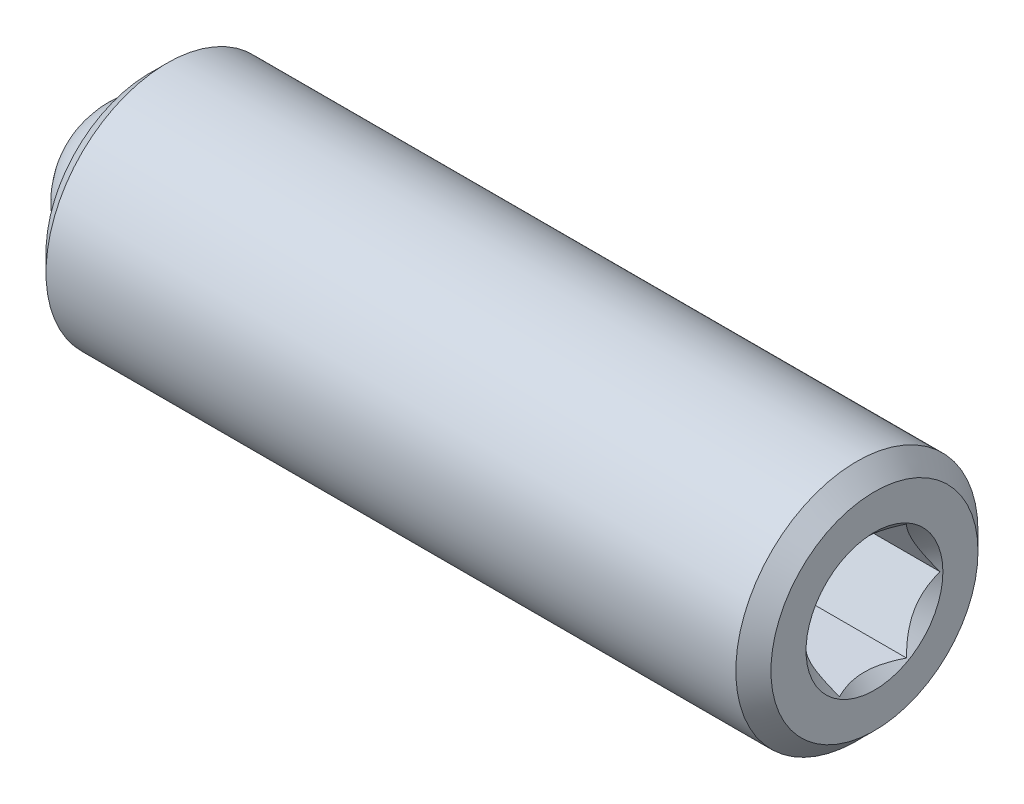
ISO-10303-21;
HEADER;
FILE_DESCRIPTION(('STEP AP214'),'2;1');
FILE_NAME('part.step','',(''),(''),'','','');
FILE_SCHEMA(('AUTOMOTIVE_DESIGN { 1 0 10303 214 1 1 1 1 }'));
ENDSEC;
DATA;
#1=APPLICATION_CONTEXT('core data for automotive mechanical design processes');
#2=APPLICATION_PROTOCOL_DEFINITION('international standard','automotive_design',2000,#1);
#3=PRODUCT_CONTEXT('',#1,'mechanical');
#4=PRODUCT('Part','Part','',(#3));
#5=PRODUCT_RELATED_PRODUCT_CATEGORY('part','',(#4));
#6=PRODUCT_DEFINITION_FORMATION('','',#4);
#7=PRODUCT_DEFINITION_CONTEXT('part definition',#1,'design');
#8=PRODUCT_DEFINITION('design','',#6,#7);
#9=PRODUCT_DEFINITION_SHAPE('','',#8);
#10=(LENGTH_UNIT() NAMED_UNIT(*) SI_UNIT(.MILLI.,.METRE.));
#11=(NAMED_UNIT(*) PLANE_ANGLE_UNIT() SI_UNIT($,.RADIAN.));
#12=(NAMED_UNIT(*) SI_UNIT($,.STERADIAN.) SOLID_ANGLE_UNIT());
#13=UNCERTAINTY_MEASURE_WITH_UNIT(LENGTH_MEASURE(1.E-05),#10,'distance_accuracy_value','');
#14=(GEOMETRIC_REPRESENTATION_CONTEXT(3) GLOBAL_UNCERTAINTY_ASSIGNED_CONTEXT((#13)) GLOBAL_UNIT_ASSIGNED_CONTEXT((#10,
#11,#12)) REPRESENTATION_CONTEXT('',''));
#15=CARTESIAN_POINT('',(0.,0.,0.));
#16=DIRECTION('',(0.,0.,1.));
#17=DIRECTION('',(1.,0.,0.));
#18=AXIS2_PLACEMENT_3D('',#15,#16,#17);
#19=CARTESIAN_POINT('',(-54.9226148346099,17.6670568230293,19.9749252728338));
#20=DIRECTION('',(1.,0.,0.));
#21=DIRECTION('',(0.,0.,-1.));
#22=AXIS2_PLACEMENT_3D('',#19,#20,#21);
#23=CYLINDRICAL_SURFACE('',#22,1.75259999999999);
#24=CARTESIAN_POINT('',(-65.1613548346099,17.6670568230293,19.9749252728338));
#25=DIRECTION('',(1.,0.,0.));
#26=DIRECTION('',(0.,0.,-1.));
#27=AXIS2_PLACEMENT_3D('',#24,#25,#26);
#28=CIRCLE('',#27,1.7526);
#29=CARTESIAN_POINT('',(-65.1613548346099,17.6670568230293,18.2223252728338));
#30=VERTEX_POINT('',#29);
#31=EDGE_CURVE('P0_E29',#30,#30,#28,.T.);
#32=ORIENTED_EDGE('',*,*,#31,.T.);
#33=EDGE_LOOP('',(#32));
#34=FACE_BOUND('',#33,.T.);
#35=CARTESIAN_POINT('',(-55.1766148346099,17.6670568230293,19.9749252728338));
#36=DIRECTION('',(1.,0.,0.));
#37=DIRECTION('',(0.,0.,-1.));
#38=AXIS2_PLACEMENT_3D('',#35,#36,#37);
#39=CIRCLE('',#38,1.75259999999998);
#40=CARTESIAN_POINT('',(-55.1766148346099,17.6670568230293,18.2223252728339));
#41=VERTEX_POINT('',#40);
#42=EDGE_CURVE('P0_E101',#41,#41,#39,.T.);
#43=ORIENTED_EDGE('',*,*,#42,.F.);
#44=EDGE_LOOP('',(#43));
#45=FACE_BOUND('',#44,.T.);
#46=ADVANCED_FACE('P0_F17',(#34,#45),#23,.T.);
#47=CARTESIAN_POINT('',(-65.4153548346099,17.6670568230293,19.9749252728338));
#48=DIRECTION('',(1.,0.,0.));
#49=DIRECTION('',(0.,0.,-1.));
#50=AXIS2_PLACEMENT_3D('',#47,#48,#49);
#51=CONICAL_SURFACE('',#50,1.49860000000003,0.785398163397484);
#52=ORIENTED_EDGE('',*,*,#31,.F.);
#53=EDGE_LOOP('',(#52));
#54=FACE_BOUND('',#53,.T.);
#55=CARTESIAN_POINT('',(-65.4153548346099,17.6670568230293,19.9749252728338));
#56=DIRECTION('',(1.,0.,0.));
#57=DIRECTION('',(0.,0.,-1.));
#58=AXIS2_PLACEMENT_3D('',#55,#56,#57);
#59=CIRCLE('',#58,1.49860000000003);
#60=CARTESIAN_POINT('',(-65.4153548346099,17.6670568230293,18.4763252728338));
#61=VERTEX_POINT('',#60);
#62=EDGE_CURVE('P0_E113',#61,#61,#59,.T.);
#63=ORIENTED_EDGE('',*,*,#62,.T.);
#64=EDGE_LOOP('',(#63));
#65=FACE_BOUND('',#64,.T.);
#66=ADVANCED_FACE('P0_F120',(#54,#65),#51,.T.);
#67=CARTESIAN_POINT('',(-65.4153548346099,8.33259115775052,19.9749252728338));
#68=DIRECTION('',(1.,0.,0.));
#69=DIRECTION('',(0.,0.,-1.));
#70=AXIS2_PLACEMENT_3D('',#67,#68,#69);
#71=PLANE('',#70);
#72=ORIENTED_EDGE('',*,*,#62,.F.);
#73=EDGE_LOOP('',(#72));
#74=FACE_BOUND('',#73,.T.);
#75=CARTESIAN_POINT('',(-65.4153548346099,17.6670568230293,19.9749252728338));
#76=DIRECTION('',(1.,0.,0.));
#77=DIRECTION('',(0.,0.,-1.));
#78=AXIS2_PLACEMENT_3D('',#75,#76,#77);
#79=CIRCLE('',#78,1.19126);
#80=CARTESIAN_POINT('',(-65.4153548346099,17.6670568230293,18.7836652728338));
#81=VERTEX_POINT('',#80);
#82=EDGE_CURVE('P0_E110',#81,#81,#79,.T.);
#83=ORIENTED_EDGE('',*,*,#82,.T.);
#84=EDGE_LOOP('',(#83));
#85=FACE_BOUND('',#84,.T.);
#86=ADVANCED_FACE('P0_F123',(#74,#85),#71,.F.);
#87=CARTESIAN_POINT('',(-54.9226148346099,17.6670568230293,19.9749252728338));
#88=DIRECTION('',(1.,0.,0.));
#89=DIRECTION('',(0.,0.,-1.));
#90=AXIS2_PLACEMENT_3D('',#87,#88,#89);
#91=CYLINDRICAL_SURFACE('',#90,1.19126);
#92=CARTESIAN_POINT('',(-64.6679187862973,17.6670568230293,19.9749252728338));
#93=DIRECTION('',(1.,0.,0.));
#94=DIRECTION('',(0.,0.,-1.));
#95=AXIS2_PLACEMENT_3D('',#92,#93,#94);
#96=CIRCLE('',#95,1.19126);
#97=CARTESIAN_POINT('',(-64.6679187862973,17.6670568230293,18.7836652728338));
#98=VERTEX_POINT('',#97);
#99=EDGE_CURVE('P0_E107',#98,#98,#96,.T.);
#100=ORIENTED_EDGE('',*,*,#99,.T.);
#101=EDGE_LOOP('',(#100));
#102=FACE_BOUND('',#101,.T.);
#103=ORIENTED_EDGE('',*,*,#82,.F.);
#104=EDGE_LOOP('',(#103));
#105=FACE_BOUND('',#104,.T.);
#106=ADVANCED_FACE('P0_F128',(#102,#105),#91,.F.);
#107=CARTESIAN_POINT('',(-63.4766587862974,17.6670568230293,19.9749252728338));
#108=DIRECTION('',(-1.,0.,0.));
#109=DIRECTION('',(0.,0.,1.));
#110=AXIS2_PLACEMENT_3D('',#107,#108,#109);
#111=CONICAL_SURFACE('',#110,0.,0.78539816339745);
#112=ORIENTED_EDGE('',*,*,#99,.F.);
#113=EDGE_LOOP('',(#112));
#114=FACE_BOUND('',#113,.T.);
#115=CARTESIAN_POINT('',(-63.4766587862974,17.6670568230293,19.9749252728338));
#116=VERTEX_POINT('',#115);
#117=VERTEX_LOOP('',#116);
#118=FACE_BOUND('',#117,.T.);
#119=ADVANCED_FACE('P0_F133',(#114,#118),#111,.F.);
#120=CARTESIAN_POINT('',(-54.9226148346099,8.33259115775052,19.9749252728338));
#121=DIRECTION('',(1.,0.,0.));
#122=DIRECTION('',(0.,0.,-1.));
#123=AXIS2_PLACEMENT_3D('',#120,#121,#122);
#124=PLANE('',#123);
#125=CARTESIAN_POINT('',(-54.9226148346099,17.6670568230293,19.9749252728338));
#126=DIRECTION('',(1.,0.,0.));
#127=DIRECTION('',(0.,0.,-1.));
#128=AXIS2_PLACEMENT_3D('',#125,#126,#127);
#129=CIRCLE('',#128,0.990600000000001);
#130=CARTESIAN_POINT('',(-54.9226148346099,17.6670568230293,18.9843252728338));
#131=VERTEX_POINT('',#130);
#132=EDGE_CURVE('P0_E284',#131,#131,#129,.T.);
#133=ORIENTED_EDGE('',*,*,#132,.F.);
#134=EDGE_LOOP('',(#133));
#135=FACE_BOUND('',#134,.T.);
#136=CARTESIAN_POINT('',(-54.9226148346099,17.6670568230293,19.9749252728338));
#137=DIRECTION('',(1.,0.,0.));
#138=DIRECTION('',(0.,0.,-1.));
#139=AXIS2_PLACEMENT_3D('',#136,#137,#138);
#140=CIRCLE('',#139,1.49860000000001);
#141=CARTESIAN_POINT('',(-54.9226148346099,17.6670568230293,18.4763252728338));
#142=VERTEX_POINT('',#141);
#143=EDGE_CURVE('P0_E104',#142,#142,#140,.T.);
#144=ORIENTED_EDGE('',*,*,#143,.T.);
#145=EDGE_LOOP('',(#144));
#146=FACE_BOUND('',#145,.T.);
#147=ADVANCED_FACE('P0_F140',(#135,#146),#124,.T.);
#148=CARTESIAN_POINT('',(-54.9226148346099,17.6670568230293,19.9749252728338));
#149=DIRECTION('',(-1.,0.,0.));
#150=DIRECTION('',(0.,0.,1.));
#151=AXIS2_PLACEMENT_3D('',#148,#149,#150);
#152=CONICAL_SURFACE('',#151,1.49860000000001,0.785398163397395);
#153=ORIENTED_EDGE('',*,*,#42,.T.);
#154=EDGE_LOOP('',(#153));
#155=FACE_BOUND('',#154,.T.);
#156=ORIENTED_EDGE('',*,*,#143,.F.);
#157=EDGE_LOOP('',(#156));
#158=FACE_BOUND('',#157,.T.);
#159=ADVANCED_FACE('P0_F176',(#155,#158),#152,.T.);
#160=CARTESIAN_POINT('',(-54.9226148346099,17.6670568230293,19.9749252728338));
#161=DIRECTION('',(1.,0.,0.));
#162=DIRECTION('',(0.,0.,-1.));
#163=AXIS2_PLACEMENT_3D('',#160,#161,#162);
#164=CONICAL_SURFACE('',#163,0.990600000000001,0.78539816339745);
#165=ORIENTED_EDGE('',*,*,#132,.T.);
#166=EDGE_LOOP('',(#165));
#167=FACE_BOUND('',#166,.T.);
#168=CARTESIAN_POINT('',(-54.9436405651255,16.8273558759166,19.4901814400065));
#169=CARTESIAN_POINT('',(-54.9602896069406,16.8562181427527,19.4735178024792));
#170=CARTESIAN_POINT('',(-54.9759608774194,16.8855629577353,19.4565755656497));
#171=CARTESIAN_POINT('',(-55.0046545524278,16.9454002240756,19.4220285038205));
#172=CARTESIAN_POINT('',(-55.0176609928538,16.9758983655022,19.4044203936581));
#173=CARTESIAN_POINT('',(-55.0399410878351,17.0373965243373,19.3689144151));
#174=CARTESIAN_POINT('',(-55.0492707427217,17.0683808795174,19.3510255892961));
#175=CARTESIAN_POINT('',(-55.0636455824224,17.1310311966433,19.3148544118386));
#176=CARTESIAN_POINT('',(-55.0687014949087,17.162695246143,19.2965731643363));
#177=CARTESIAN_POINT('',(-55.0732616796192,17.2172701926042,19.265064304306));
#178=CARTESIAN_POINT('',(-55.0739356716225,17.2401101782143,19.2518776324657));
#179=CARTESIAN_POINT('',(-55.0728008985711,17.2857458621748,19.2255298580464));
#180=CARTESIAN_POINT('',(-55.0709915852855,17.3085415496331,19.2123687617561));
#181=CARTESIAN_POINT('',(-55.0619582613821,17.3766029687753,19.1730734830929));
#182=CARTESIAN_POINT('',(-55.0511278474807,17.4215299214417,19.1471348948771));
#183=CARTESIAN_POINT('',(-55.0249992136131,17.5003581449836,19.1016233987954));
#184=CARTESIAN_POINT('',(-55.0110739425726,17.5346300462523,19.0818365073723));
#185=CARTESIAN_POINT('',(-54.9797070603181,17.6018322633575,19.0430372892364));
#186=CARTESIAN_POINT('',(-54.9622768940473,17.6347665368975,19.0240226775425));
#187=CARTESIAN_POINT('',(-54.9436405651256,17.6671068230293,19.0053510046387));
#188=B_SPLINE_CURVE_WITH_KNOTS('',3,(#168,#169,#170,#171,#172,#173,#174,#175,#176,#177,#178,
#179,#180,#181,#182,#183,#184,#185,#186,#187),.UNSPECIFIED.,.F.,.F.,(4,2,2,2,2,2,2,2,2,4),(0.,
0.11184086641355,0.22433331345316,0.335039259016712,0.445466485422691,0.524497596560953,
0.603546157935341,0.761688164949791,0.887377330429817,1.01266254554963),.UNSPECIFIED.);
#189=CARTESIAN_POINT('',(-54.9436694339282,16.8274058759166,19.490152572493));
#190=VERTEX_POINT('',#189);
#191=CARTESIAN_POINT('',(-54.9436694339282,17.6670568230293,19.0053798721522));
#192=VERTEX_POINT('',#191);
#193=EDGE_CURVE('P0_E85',#190,#192,#188,.T.);
#194=ORIENTED_EDGE('',*,*,#193,.F.);
#195=CARTESIAN_POINT('',(-54.6608222819,16.8274058759166,19.0456925823327));
#196=CARTESIAN_POINT('',(-54.6777392309002,16.8274058759166,19.0684962812722));
#197=CARTESIAN_POINT('',(-54.6944790902186,16.8274058759166,19.0914310185545));
#198=CARTESIAN_POINT('',(-54.7275326745997,16.8274058759166,19.1376143062626));
#199=CARTESIAN_POINT('',(-54.7438462866447,16.8274058759166,19.1608629374868));
#200=CARTESIAN_POINT('',(-54.7922716573543,16.8274058759166,19.231496791127));
#201=CARTESIAN_POINT('',(-54.8236073030778,16.8274058759166,19.2794232867069));
#202=CARTESIAN_POINT('',(-54.8847907056742,16.8274058759166,19.379687947564));
#203=CARTESIAN_POINT('',(-54.9144767841672,16.8274058759166,19.4321259771547));
#204=CARTESIAN_POINT('',(-54.9685436669656,16.8274058759166,19.5395709034503));
#205=CARTESIAN_POINT('',(-54.9929422838207,16.8274058759166,19.5945683922659));
#206=CARTESIAN_POINT('',(-55.0227791782577,16.8274058759166,19.6774903298755));
#207=CARTESIAN_POINT('',(-55.0314019850758,16.8274058759166,19.70426561621));
#208=CARTESIAN_POINT('',(-55.0464925522159,16.8274058759166,19.7584296604999));
#209=CARTESIAN_POINT('',(-55.0529601529813,16.8274058759166,19.7858184637157));
#210=CARTESIAN_POINT('',(-55.0633051728295,16.8274058759166,19.8406012916713));
#211=CARTESIAN_POINT('',(-55.0672251441037,16.8274058759166,19.8679871580931));
#212=CARTESIAN_POINT('',(-55.0724069079885,16.8274058759166,19.9230195994479));
#213=CARTESIAN_POINT('',(-55.0736682165128,16.8274058759166,19.9506662209386));
#214=CARTESIAN_POINT('',(-55.0734493629588,16.8274058759166,20.0050961010845));
#215=CARTESIAN_POINT('',(-55.072052407696,16.8274058759166,20.0318797353216));
#216=CARTESIAN_POINT('',(-55.0667692155749,16.8274058759166,20.0852013847964));
#217=CARTESIAN_POINT('',(-55.0628824783849,16.8274058759166,20.1117393495782));
#218=CARTESIAN_POINT('',(-55.0527594294364,16.8274058759166,20.1648222775657));
#219=CARTESIAN_POINT('',(-55.046484488545,16.8274058759166,20.1913597669272));
#220=CARTESIAN_POINT('',(-55.0319070670182,16.8274058759166,20.2438590877009));
#221=CARTESIAN_POINT('',(-55.0236047994101,16.8274058759166,20.2698209792834));
#222=CARTESIAN_POINT('',(-54.9938112359399,16.8274058759166,20.3533728316223));
#223=CARTESIAN_POINT('',(-54.9688534043347,16.8274058759166,20.4097241281571));
#224=CARTESIAN_POINT('',(-54.9134212329817,16.8274058759166,20.5197610464284));
#225=CARTESIAN_POINT('',(-54.8829266947096,16.8274058759166,20.5734359590264));
#226=CARTESIAN_POINT('',(-54.820077945697,16.8274058759166,20.6759853410194));
#227=CARTESIAN_POINT('',(-54.7878941085104,16.8274058759166,20.7249655092824));
#228=CARTESIAN_POINT('',(-54.7381680820728,16.8274058759166,20.797129117419));
#229=CARTESIAN_POINT('',(-54.7214225653475,16.8274058759166,20.8208712315236));
#230=CARTESIAN_POINT('',(-54.6874957572723,16.8274058759166,20.8680325796217));
#231=CARTESIAN_POINT('',(-54.6703145858601,16.8274058759166,20.891451899799));
#232=CARTESIAN_POINT('',(-54.6529529843744,16.8274058759166,20.9147370721701));
#233=B_SPLINE_CURVE_WITH_KNOTS('',3,(#195,#196,#197,#198,#199,#200,#201,#202,#203,#204,#205,
#206,#207,#208,#209,#210,#211,#212,#213,#214,#215,#216,#217,#218,#219,#220,#221,#222,#223,#224,
#225,#226,#227,#228,#229,#230,#231,#232),.UNSPECIFIED.,.F.,.F.,(4,2,2,2,2,2,2,2,2,2,2,2,2,2,2,2,
2,2,4),(0.,0.0851782767472509,0.170378913595555,0.342080530368617,0.522695305959887,
0.702691822093995,0.787008041035522,0.871330500779149,0.954205660968574,1.03709590966945,
1.1174341951901,1.19778863008206,1.27950219291687,1.36120717315376,1.54555233711183,
1.73058404283967,1.90632074636969,1.9934777254289,2.08061096486619),.UNSPECIFIED.);
#234=CARTESIAN_POINT('',(-54.9436694339282,16.8274058759166,20.4596979731747));
#235=VERTEX_POINT('',#234);
#236=EDGE_CURVE('P0_E271',#235,#190,#233,.F.);
#237=ORIENTED_EDGE('',*,*,#236,.F.);
#238=CARTESIAN_POINT('',(-54.9436405651256,17.6671068230293,20.944499541029));
#239=CARTESIAN_POINT('',(-54.9602896069406,17.6382445561931,20.9278359035017));
#240=CARTESIAN_POINT('',(-54.9759608774194,17.6088997412105,20.9108936666722));
#241=CARTESIAN_POINT('',(-55.0046545524278,17.5490624748702,20.876346604843));
#242=CARTESIAN_POINT('',(-55.0176609928538,17.5185643334436,20.8587384946806));
#243=CARTESIAN_POINT('',(-55.0399410878351,17.4570661746086,20.8232325161225));
#244=CARTESIAN_POINT('',(-55.0492707427217,17.4260818194285,20.8053436903186));
#245=CARTESIAN_POINT('',(-55.0636455824224,17.3634315023026,20.7691725128612));
#246=CARTESIAN_POINT('',(-55.0687014949087,17.3317674528028,20.7508912653588));
#247=CARTESIAN_POINT('',(-55.0732616796192,17.2771925063416,20.7193824053285));
#248=CARTESIAN_POINT('',(-55.0739356716225,17.2543525207316,20.7061957334882));
#249=CARTESIAN_POINT('',(-55.0728008985711,17.208716836771,20.679847959069));
#250=CARTESIAN_POINT('',(-55.0709915852855,17.1859211493128,20.6666868627786));
#251=CARTESIAN_POINT('',(-55.0619582613821,17.1178597301706,20.6273915841154));
#252=CARTESIAN_POINT('',(-55.0511278474807,17.0729327775042,20.6014529958996));
#253=CARTESIAN_POINT('',(-55.0249992136131,16.9941045539623,20.5559414998179));
#254=CARTESIAN_POINT('',(-55.0110739425726,16.9598326526936,20.5361546083948));
#255=CARTESIAN_POINT('',(-54.9797070603181,16.8926304355883,20.4973553902589));
#256=CARTESIAN_POINT('',(-54.9622768940473,16.8596961620483,20.478340778565));
#257=CARTESIAN_POINT('',(-54.9436405651255,16.8273558759166,20.4596691056612));
#258=B_SPLINE_CURVE_WITH_KNOTS('',3,(#238,#239,#240,#241,#242,#243,#244,#245,#246,#247,#248,
#249,#250,#251,#252,#253,#254,#255,#256,#257),.UNSPECIFIED.,.F.,.F.,(4,2,2,2,2,2,2,2,2,4),(0.,
0.111840866413552,0.224333313453157,0.335039259016705,0.445466485422674,0.524497596560936,
0.603546157935324,0.761688164949773,0.887377330429814,1.01266254554964),.UNSPECIFIED.);
#259=CARTESIAN_POINT('',(-54.9436694339282,17.6670568230293,20.9444706735155));
#260=VERTEX_POINT('',#259);
#261=EDGE_CURVE('P0_E267',#260,#235,#258,.T.);
#262=ORIENTED_EDGE('',*,*,#261,.F.);
#263=CARTESIAN_POINT('',(-54.9436405651255,18.506757770142,20.4596691056612));
#264=CARTESIAN_POINT('',(-54.9602896069406,18.4778955033058,20.4763327431885));
#265=CARTESIAN_POINT('',(-54.9759608774194,18.4485506883232,20.493274980018));
#266=CARTESIAN_POINT('',(-55.0046545524278,18.3887134219829,20.5278220418471));
#267=CARTESIAN_POINT('',(-55.0176609928538,18.3582152805563,20.5454301520096));
#268=CARTESIAN_POINT('',(-55.039941087835,18.2967171217213,20.5809361305677));
#269=CARTESIAN_POINT('',(-55.0492707427217,18.2657327665411,20.5988249563716));
#270=CARTESIAN_POINT('',(-55.0636455824224,18.2030824494152,20.634996133829));
#271=CARTESIAN_POINT('',(-55.0687014949087,18.1714183999155,20.6532773813313));
#272=CARTESIAN_POINT('',(-55.0732616796192,18.1168434534543,20.6847862413617));
#273=CARTESIAN_POINT('',(-55.0739356716225,18.0940034678443,20.697972913202));
#274=CARTESIAN_POINT('',(-55.0728008985711,18.0483677838837,20.7243206876212));
#275=CARTESIAN_POINT('',(-55.0709915852855,18.0255720964255,20.7374817839116));
#276=CARTESIAN_POINT('',(-55.0619582613821,17.9575106772833,20.7767770625748));
#277=CARTESIAN_POINT('',(-55.0511278474807,17.9125837246169,20.8027156507906));
#278=CARTESIAN_POINT('',(-55.0249992136131,17.833755501075,20.8482271468723));
#279=CARTESIAN_POINT('',(-55.0110739425726,17.7994835998063,20.8680140382954));
#280=CARTESIAN_POINT('',(-54.9797070603181,17.732281382701,20.9068132564313));
#281=CARTESIAN_POINT('',(-54.9622768940473,17.699347109161,20.9258278681252));
#282=CARTESIAN_POINT('',(-54.9436405651256,17.6670068230293,20.944499541029));
#283=B_SPLINE_CURVE_WITH_KNOTS('',3,(#263,#264,#265,#266,#267,#268,#269,#270,#271,#272,#273,
#274,#275,#276,#277,#278,#279,#280,#281,#282),.UNSPECIFIED.,.F.,.F.,(4,2,2,2,2,2,2,2,2,4),(0.,
0.111840866413555,0.224333313453164,0.335039259016714,0.445466485422691,0.524497596560956,
0.603546157935342,0.76168816494979,0.887377330429826,1.01266254554964),.UNSPECIFIED.);
#284=CARTESIAN_POINT('',(-54.9436694339282,18.506707770142,20.4596979731747));
#285=VERTEX_POINT('',#284);
#286=EDGE_CURVE('P0_E36',#285,#260,#283,.T.);
#287=ORIENTED_EDGE('',*,*,#286,.F.);
#288=CARTESIAN_POINT('',(-54.6608222819,18.5067077701419,19.0456925823327));
#289=CARTESIAN_POINT('',(-54.6777392309002,18.5067077701419,19.0684962812722));
#290=CARTESIAN_POINT('',(-54.6944790902186,18.5067077701419,19.0914310185545));
#291=CARTESIAN_POINT('',(-54.7275326745998,18.5067077701419,19.1376143062626));
#292=CARTESIAN_POINT('',(-54.7438462866447,18.5067077701419,19.1608629374868));
#293=CARTESIAN_POINT('',(-54.7922716573543,18.5067077701419,19.231496791127));
#294=CARTESIAN_POINT('',(-54.8236073030778,18.506707770142,19.2794232867069));
#295=CARTESIAN_POINT('',(-54.8847907056742,18.506707770142,19.379687947564));
#296=CARTESIAN_POINT('',(-54.9144767841673,18.506707770142,19.4321259771547));
#297=CARTESIAN_POINT('',(-54.9685436669656,18.506707770142,19.5395709034503));
#298=CARTESIAN_POINT('',(-54.9929422838208,18.506707770142,19.5945683922659));
#299=CARTESIAN_POINT('',(-55.0227791782578,18.506707770142,19.6774903298755));
#300=CARTESIAN_POINT('',(-55.0314019850758,18.506707770142,19.70426561621));
#301=CARTESIAN_POINT('',(-55.0464925522159,18.506707770142,19.7584296604999));
#302=CARTESIAN_POINT('',(-55.0529601529813,18.506707770142,19.7858184637157));
#303=CARTESIAN_POINT('',(-55.0633051728295,18.506707770142,19.8406012916713));
#304=CARTESIAN_POINT('',(-55.0672251441037,18.506707770142,19.8679871580931));
#305=CARTESIAN_POINT('',(-55.0724069079885,18.506707770142,19.9230195994479));
#306=CARTESIAN_POINT('',(-55.0736682165128,18.506707770142,19.9506662209386));
#307=CARTESIAN_POINT('',(-55.0734493629589,18.506707770142,20.0050961010845));
#308=CARTESIAN_POINT('',(-55.072052407696,18.506707770142,20.0318797353216));
#309=CARTESIAN_POINT('',(-55.0667692155749,18.506707770142,20.0852013847964));
#310=CARTESIAN_POINT('',(-55.0628824783849,18.506707770142,20.1117393495782));
#311=CARTESIAN_POINT('',(-55.0527594294365,18.506707770142,20.1648222775657));
#312=CARTESIAN_POINT('',(-55.046484488545,18.506707770142,20.1913597669271));
#313=CARTESIAN_POINT('',(-55.0319070670182,18.506707770142,20.2438590877009));
#314=CARTESIAN_POINT('',(-55.0236047994101,18.506707770142,20.2698209792834));
#315=CARTESIAN_POINT('',(-54.9938112359399,18.506707770142,20.3533728316222));
#316=CARTESIAN_POINT('',(-54.9688534043347,18.506707770142,20.4097241281571));
#317=CARTESIAN_POINT('',(-54.9134212329817,18.506707770142,20.5197610464284));
#318=CARTESIAN_POINT('',(-54.8829266947096,18.506707770142,20.5734359590263));
#319=CARTESIAN_POINT('',(-54.820077945697,18.506707770142,20.6759853410194));
#320=CARTESIAN_POINT('',(-54.7878941085104,18.506707770142,20.7249655092824));
#321=CARTESIAN_POINT('',(-54.7381680820728,18.506707770142,20.797129117419));
#322=CARTESIAN_POINT('',(-54.7214225653475,18.506707770142,20.8208712315236));
#323=CARTESIAN_POINT('',(-54.6874957572724,18.506707770142,20.8680325796217));
#324=CARTESIAN_POINT('',(-54.6703145858601,18.506707770142,20.891451899799));
#325=CARTESIAN_POINT('',(-54.6529529843744,18.506707770142,20.9147370721701));
#326=B_SPLINE_CURVE_WITH_KNOTS('',3,(#288,#289,#290,#291,#292,#293,#294,#295,#296,#297,#298,
#299,#300,#301,#302,#303,#304,#305,#306,#307,#308,#309,#310,#311,#312,#313,#314,#315,#316,#317,
#318,#319,#320,#321,#322,#323,#324,#325),.UNSPECIFIED.,.F.,.F.,(4,2,2,2,2,2,2,2,2,2,2,2,2,2,2,2,
2,2,4),(0.,0.0851782767472509,0.170378913595546,0.342080530368607,0.522695305959877,
0.702691822093982,0.787008041035515,0.871330500779139,0.954205660968557,1.03709590966943,
1.11743419519008,1.19778863008204,1.27950219291684,1.36120717315373,1.54555233711181,
1.73058404283964,1.90632074636966,1.99347772542888,2.08061096486616),.UNSPECIFIED.);
#327=CARTESIAN_POINT('',(-54.9436694339282,18.506707770142,19.490152572493));
#328=VERTEX_POINT('',#327);
#329=EDGE_CURVE('P0_E11',#328,#285,#326,.T.);
#330=ORIENTED_EDGE('',*,*,#329,.F.);
#331=CARTESIAN_POINT('',(-54.9436405651256,17.6670068230293,19.0053510046387));
#332=CARTESIAN_POINT('',(-54.9602896069406,17.6958690898654,19.022014642166));
#333=CARTESIAN_POINT('',(-54.9759608774194,17.725213904848,19.0389568789955));
#334=CARTESIAN_POINT('',(-55.0046545524278,17.7850511711883,19.0735039408246));
#335=CARTESIAN_POINT('',(-55.0176609928538,17.8155493126149,19.0911120509871));
#336=CARTESIAN_POINT('',(-55.0399410878351,17.87704747145,19.1266180295452));
#337=CARTESIAN_POINT('',(-55.0492707427217,17.9080318266301,19.1445068553491));
#338=CARTESIAN_POINT('',(-55.0636455824224,17.970682143756,19.1806780328065));
#339=CARTESIAN_POINT('',(-55.0687014949087,18.0023461932557,19.1989592803088));
#340=CARTESIAN_POINT('',(-55.0732616796192,18.0569211397169,19.2304681403392));
#341=CARTESIAN_POINT('',(-55.0739356716225,18.079761125327,19.2436548121795));
#342=CARTESIAN_POINT('',(-55.0728008985711,18.1253968092875,19.2700025865987));
#343=CARTESIAN_POINT('',(-55.0709915852855,18.1481924967458,19.2831636828891));
#344=CARTESIAN_POINT('',(-55.0619582613821,18.216253915888,19.3224589615523));
#345=CARTESIAN_POINT('',(-55.0511278474807,18.2611808685543,19.3483975497681));
#346=CARTESIAN_POINT('',(-55.0249992136131,18.3400090920963,19.3939090458498));
#347=CARTESIAN_POINT('',(-55.0110739425726,18.3742809933649,19.4136959372729));
#348=CARTESIAN_POINT('',(-54.9797070603181,18.4414832104702,19.4524951554087));
#349=CARTESIAN_POINT('',(-54.9622768940473,18.4744174840102,19.4715097671026));
#350=CARTESIAN_POINT('',(-54.9436405651256,18.506757770142,19.4901814400065));
#351=B_SPLINE_CURVE_WITH_KNOTS('',3,(#331,#332,#333,#334,#335,#336,#337,#338,#339,#340,#341,
#342,#343,#344,#345,#346,#347,#348,#349,#350),.UNSPECIFIED.,.F.,.F.,(4,2,2,2,2,2,2,2,2,4),(0.,
0.111840866413552,0.224333313453157,0.335039259016702,0.445466485422674,0.524497596560936,
0.603546157935325,0.761688164949774,0.887377330429805,1.01266254554962),.UNSPECIFIED.);
#352=EDGE_CURVE('P0_E72',#192,#328,#351,.T.);
#353=ORIENTED_EDGE('',*,*,#352,.F.);
#354=EDGE_LOOP('',(#194,#237,#262,#287,#330,#353));
#355=FACE_BOUND('',#354,.T.);
#356=ADVANCED_FACE('P0_F71',(#167,#355),#164,.F.);
#357=CARTESIAN_POINT('',(-57.9706148346099,17.6670568230293,16.6426499337745));
#358=DIRECTION('',(1.,0.,0.));
#359=DIRECTION('',(0.,0.,-1.));
#360=AXIS2_PLACEMENT_3D('',#357,#358,#359);
#361=PLANE('',#360);
#362=DIRECTION('',(0.,0.86602540378444,0.499999999999997));
#363=VECTOR('',#362,1.);
#364=CARTESIAN_POINT('',(-57.9706148346099,16.6439647485707,18.4146973875578));
#365=LINE('',#364,#363);
#366=CARTESIAN_POINT('',(-57.9706148346099,17.6670568230293,19.0053798721522));
#367=VERTEX_POINT('',#366);
#368=CARTESIAN_POINT('',(-57.9706148346099,18.506707770142,19.490152572493));
#369=VERTEX_POINT('',#368);
#370=EDGE_CURVE('P0_E84',#367,#369,#365,.T.);
#371=ORIENTED_EDGE('',*,*,#370,.T.);
#372=DIRECTION('',(0.,0.,1.));
#373=VECTOR('',#372,1.);
#374=CARTESIAN_POINT('',(-57.9706148346099,18.5067077701419,16.6426499337745));
#375=LINE('',#374,#373);
#376=CARTESIAN_POINT('',(-57.9706148346099,18.506707770142,20.4596979731747));
#377=VERTEX_POINT('',#376);
#378=EDGE_CURVE('P0_E89',#369,#377,#375,.T.);
#379=ORIENTED_EDGE('',*,*,#378,.T.);
#380=DIRECTION('',(0.,-0.866025403784441,0.499999999999996));
#381=VECTOR('',#380,1.);
#382=CARTESIAN_POINT('',(-57.9706148346099,19.5297998446005,19.8690154885803));
#383=LINE('',#382,#381);
#384=CARTESIAN_POINT('',(-57.9706148346099,17.6670568230293,20.9444706735155));
#385=VERTEX_POINT('',#384);
#386=EDGE_CURVE('P0_E304',#377,#385,#383,.T.);
#387=ORIENTED_EDGE('',*,*,#386,.T.);
#388=DIRECTION('',(0.,-0.866025403784441,-0.499999999999996));
#389=VECTOR('',#388,1.);
#390=CARTESIAN_POINT('',(-57.9706148346099,15.804313801458,19.8690154885803));
#391=LINE('',#390,#389);
#392=CARTESIAN_POINT('',(-57.9706148346099,16.8274058759166,20.4596979731747));
#393=VERTEX_POINT('',#392);
#394=EDGE_CURVE('P0_E293',#385,#393,#391,.T.);
#395=ORIENTED_EDGE('',*,*,#394,.T.);
#396=DIRECTION('',(0.,0.,-1.));
#397=VECTOR('',#396,1.);
#398=CARTESIAN_POINT('',(-57.9706148346099,16.8274058759166,16.6426499337745));
#399=LINE('',#398,#397);
#400=CARTESIAN_POINT('',(-57.9706148346099,16.8274058759166,19.490152572493));
#401=VERTEX_POINT('',#400);
#402=EDGE_CURVE('P0_E97',#393,#401,#399,.T.);
#403=ORIENTED_EDGE('',*,*,#402,.T.);
#404=DIRECTION('',(0.,0.866025403784444,-0.499999999999991));
#405=VECTOR('',#404,1.);
#406=CARTESIAN_POINT('',(-57.9706148346099,18.6901488974878,18.4146973875578));
#407=LINE('',#406,#405);
#408=EDGE_CURVE('P0_E92',#401,#367,#407,.T.);
#409=ORIENTED_EDGE('',*,*,#408,.T.);
#410=EDGE_LOOP('',(#371,#379,#387,#395,#403,#409));
#411=FACE_BOUND('',#410,.T.);
#412=ADVANCED_FACE('P0_F191',(#411),#361,.T.);
#413=CARTESIAN_POINT('',(-57.9706148346099,18.5067077701419,16.6426499337745));
#414=DIRECTION('',(0.,1.,0.));
#415=DIRECTION('',(0.,0.,1.));
#416=AXIS2_PLACEMENT_3D('',#413,#414,#415);
#417=PLANE('',#416);
#418=DIRECTION('',(1.,0.,0.));
#419=VECTOR('',#418,1.);
#420=CARTESIAN_POINT('',(-57.9706148346099,18.506707770142,19.490152572493));
#421=LINE('',#420,#419);
#422=EDGE_CURVE('P0_E81',#369,#328,#421,.T.);
#423=ORIENTED_EDGE('',*,*,#422,.T.);
#424=ORIENTED_EDGE('',*,*,#329,.T.);
#425=DIRECTION('',(1.,0.,0.));
#426=VECTOR('',#425,1.);
#427=CARTESIAN_POINT('',(-57.9706148346099,18.506707770142,20.4596979731747));
#428=LINE('',#427,#426);
#429=EDGE_CURVE('P0_E91',#377,#285,#428,.T.);
#430=ORIENTED_EDGE('',*,*,#429,.F.);
#431=ORIENTED_EDGE('',*,*,#378,.F.);
#432=EDGE_LOOP('',(#423,#424,#430,#431));
#433=FACE_BOUND('',#432,.T.);
#434=ADVANCED_FACE('P0_F87',(#433),#417,.F.);
#435=CARTESIAN_POINT('',(-57.9706148346099,19.5297998446005,19.8690154885803));
#436=DIRECTION('',(0.,0.499999999999996,0.866025403784441));
#437=DIRECTION('',(0.,-0.866025403784441,0.499999999999996));
#438=AXIS2_PLACEMENT_3D('',#435,#436,#437);
#439=PLANE('',#438);
#440=ORIENTED_EDGE('',*,*,#429,.T.);
#441=ORIENTED_EDGE('',*,*,#286,.T.);
#442=DIRECTION('',(1.,0.,0.));
#443=VECTOR('',#442,1.);
#444=CARTESIAN_POINT('',(-57.9706148346099,17.6670568230293,20.9444706735155));
#445=LINE('',#444,#443);
#446=EDGE_CURVE('P0_E94',#385,#260,#445,.T.);
#447=ORIENTED_EDGE('',*,*,#446,.F.);
#448=ORIENTED_EDGE('',*,*,#386,.F.);
#449=EDGE_LOOP('',(#440,#441,#447,#448));
#450=FACE_BOUND('',#449,.T.);
#451=ADVANCED_FACE('P0_F205',(#450),#439,.F.);
#452=CARTESIAN_POINT('',(-57.9706148346099,15.804313801458,19.8690154885803));
#453=DIRECTION('',(0.,-0.499999999999996,0.866025403784441));
#454=DIRECTION('',(0.,-0.866025403784441,-0.499999999999996));
#455=AXIS2_PLACEMENT_3D('',#452,#453,#454);
#456=PLANE('',#455);
#457=ORIENTED_EDGE('',*,*,#446,.T.);
#458=ORIENTED_EDGE('',*,*,#261,.T.);
#459=DIRECTION('',(1.,0.,0.));
#460=VECTOR('',#459,1.);
#461=CARTESIAN_POINT('',(-57.9706148346099,16.8274058759166,20.4596979731747));
#462=LINE('',#461,#460);
#463=EDGE_CURVE('P0_E295',#393,#235,#462,.T.);
#464=ORIENTED_EDGE('',*,*,#463,.F.);
#465=ORIENTED_EDGE('',*,*,#394,.F.);
#466=EDGE_LOOP('',(#457,#458,#464,#465));
#467=FACE_BOUND('',#466,.T.);
#468=ADVANCED_FACE('P0_F211',(#467),#456,.F.);
#469=CARTESIAN_POINT('',(-57.9706148346099,16.8274058759166,16.6426499337745));
#470=DIRECTION('',(0.,-1.,0.));
#471=DIRECTION('',(0.,0.,-1.));
#472=AXIS2_PLACEMENT_3D('',#469,#470,#471);
#473=PLANE('',#472);
#474=ORIENTED_EDGE('',*,*,#463,.T.);
#475=ORIENTED_EDGE('',*,*,#236,.T.);
#476=DIRECTION('',(1.,0.,0.));
#477=VECTOR('',#476,1.);
#478=CARTESIAN_POINT('',(-57.9706148346099,16.8274058759166,19.490152572493));
#479=LINE('',#478,#477);
#480=EDGE_CURVE('P0_E296',#401,#190,#479,.T.);
#481=ORIENTED_EDGE('',*,*,#480,.F.);
#482=ORIENTED_EDGE('',*,*,#402,.F.);
#483=EDGE_LOOP('',(#474,#475,#481,#482));
#484=FACE_BOUND('',#483,.T.);
#485=ADVANCED_FACE('P0_F219',(#484),#473,.F.);
#486=CARTESIAN_POINT('',(-57.9706148346099,18.6901488974878,18.4146973875578));
#487=DIRECTION('',(0.,-0.499999999999991,-0.866025403784444));
#488=DIRECTION('',(0.,0.866025403784444,-0.499999999999991));
#489=AXIS2_PLACEMENT_3D('',#486,#487,#488);
#490=PLANE('',#489);
#491=ORIENTED_EDGE('',*,*,#480,.T.);
#492=ORIENTED_EDGE('',*,*,#193,.T.);
#493=DIRECTION('',(1.,0.,0.));
#494=VECTOR('',#493,1.);
#495=CARTESIAN_POINT('',(-57.9706148346099,17.6670568230293,19.0053798721522));
#496=LINE('',#495,#494);
#497=EDGE_CURVE('P0_E83',#367,#192,#496,.T.);
#498=ORIENTED_EDGE('',*,*,#497,.F.);
#499=ORIENTED_EDGE('',*,*,#408,.F.);
#500=EDGE_LOOP('',(#491,#492,#498,#499));
#501=FACE_BOUND('',#500,.T.);
#502=ADVANCED_FACE('P0_F227',(#501),#490,.F.);
#503=CARTESIAN_POINT('',(-57.9706148346099,16.6439647485707,18.4146973875578));
#504=DIRECTION('',(0.,0.499999999999997,-0.86602540378444));
#505=DIRECTION('',(0.,0.866025403784441,0.499999999999997));
#506=AXIS2_PLACEMENT_3D('',#503,#504,#505);
#507=PLANE('',#506);
#508=ORIENTED_EDGE('',*,*,#497,.T.);
#509=ORIENTED_EDGE('',*,*,#352,.T.);
#510=ORIENTED_EDGE('',*,*,#422,.F.);
#511=ORIENTED_EDGE('',*,*,#370,.F.);
#512=EDGE_LOOP('',(#508,#509,#510,#511));
#513=FACE_BOUND('',#512,.T.);
#514=ADVANCED_FACE('P0_F79',(#513),#507,.F.);
#515=CLOSED_SHELL('',(#46,#66,#86,#106,#119,#147,#159,#356,#412,#434,#451,#468,#485,#502,#514));
#516=MANIFOLD_SOLID_BREP('P0_B1',#515);
#517=CARTESIAN_POINT('',(-65.1613548346099,17.6670568230293,19.9749252728338));
#518=DIRECTION('',(1.,0.,0.));
#519=DIRECTION('',(0.,-1.,0.));
#520=AXIS2_PLACEMENT_3D('',#517,#518,#519);
#521=SPHERICAL_SURFACE('',#520,1.19126);
#522=CARTESIAN_POINT('',(-63.9700948346099,17.6670568230293,19.9749252728338));
#523=VERTEX_POINT('',#522);
#524=VERTEX_LOOP('',#523);
#525=FACE_BOUND('',#524,.T.);
#526=ADVANCED_FACE('P1_F12',(#525),#521,.T.);
#527=CLOSED_SHELL('',(#526));
#528=MANIFOLD_SOLID_BREP('P1_B1',#527);
#529=ADVANCED_BREP_SHAPE_REPRESENTATION('',(#18,#516,#528),#14);
#530=SHAPE_DEFINITION_REPRESENTATION(#9,#529);
ENDSEC;
END-ISO-10303-21;
